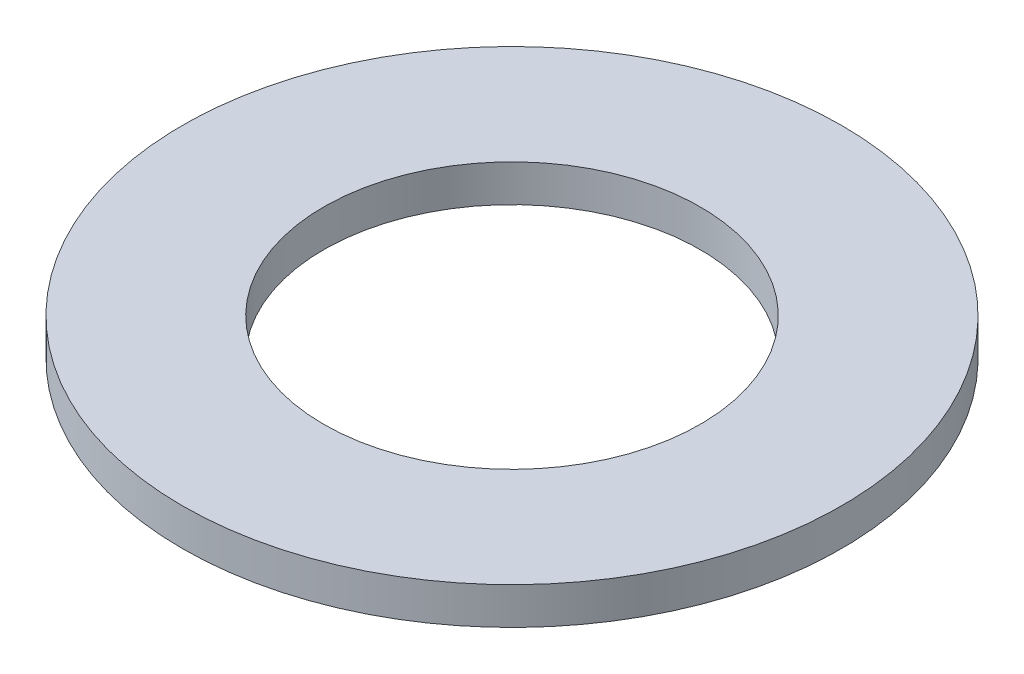
ISO-10303-21;
HEADER;
FILE_DESCRIPTION(('STEP AP214'),'2;1');
FILE_NAME('part.step','',(''),(''),'','','');
FILE_SCHEMA(('AUTOMOTIVE_DESIGN { 1 0 10303 214 1 1 1 1 }'));
ENDSEC;
DATA;
#1=APPLICATION_CONTEXT('core data for automotive mechanical design processes');
#2=APPLICATION_PROTOCOL_DEFINITION('international standard','automotive_design',2000,#1);
#3=PRODUCT_CONTEXT('',#1,'mechanical');
#4=PRODUCT('Part','Part','',(#3));
#5=PRODUCT_RELATED_PRODUCT_CATEGORY('part','',(#4));
#6=PRODUCT_DEFINITION_FORMATION('','',#4);
#7=PRODUCT_DEFINITION_CONTEXT('part definition',#1,'design');
#8=PRODUCT_DEFINITION('design','',#6,#7);
#9=PRODUCT_DEFINITION_SHAPE('','',#8);
#10=(LENGTH_UNIT() NAMED_UNIT(*) SI_UNIT(.MILLI.,.METRE.));
#11=(NAMED_UNIT(*) PLANE_ANGLE_UNIT() SI_UNIT($,.RADIAN.));
#12=(NAMED_UNIT(*) SI_UNIT($,.STERADIAN.) SOLID_ANGLE_UNIT());
#13=UNCERTAINTY_MEASURE_WITH_UNIT(LENGTH_MEASURE(1.E-05),#10,'distance_accuracy_value','');
#14=(GEOMETRIC_REPRESENTATION_CONTEXT(3) GLOBAL_UNCERTAINTY_ASSIGNED_CONTEXT((#13)) GLOBAL_UNIT_ASSIGNED_CONTEXT((#10,
#11,#12)) REPRESENTATION_CONTEXT('',''));
#15=CARTESIAN_POINT('',(0.,0.,0.));
#16=DIRECTION('',(0.,0.,1.));
#17=DIRECTION('',(1.,0.,0.));
#18=AXIS2_PLACEMENT_3D('',#15,#16,#17);
#19=CARTESIAN_POINT('',(0.,10.,0.));
#20=DIRECTION('',(0.,-1.,0.));
#21=DIRECTION('',(0.,0.,-1.));
#22=AXIS2_PLACEMENT_3D('',#19,#20,#21);
#23=CYLINDRICAL_SURFACE('',#22,88.9);
#24=CARTESIAN_POINT('',(0.,10.,0.));
#25=DIRECTION('',(0.,1.,0.));
#26=DIRECTION('',(0.,0.,1.));
#27=AXIS2_PLACEMENT_3D('',#24,#25,#26);
#28=CIRCLE('',#27,88.9);
#29=CARTESIAN_POINT('',(0.,10.,88.9));
#30=VERTEX_POINT('',#29);
#31=EDGE_CURVE('E10',#30,#30,#28,.T.);
#32=ORIENTED_EDGE('',*,*,#31,.F.);
#33=EDGE_LOOP('',(#32));
#34=FACE_BOUND('',#33,.T.);
#35=CARTESIAN_POINT('',(0.,0.,0.));
#36=DIRECTION('',(0.,1.,0.));
#37=DIRECTION('',(0.,0.,1.));
#38=AXIS2_PLACEMENT_3D('',#35,#36,#37);
#39=CIRCLE('',#38,88.9);
#40=CARTESIAN_POINT('',(0.,0.,88.9));
#41=VERTEX_POINT('',#40);
#42=EDGE_CURVE('E39',#41,#41,#39,.T.);
#43=ORIENTED_EDGE('',*,*,#42,.T.);
#44=EDGE_LOOP('',(#43));
#45=FACE_BOUND('',#44,.T.);
#46=ADVANCED_FACE('F36',(#34,#45),#23,.T.);
#47=CARTESIAN_POINT('',(0.,10.,0.));
#48=DIRECTION('',(0.,1.,0.));
#49=DIRECTION('',(0.,0.,1.));
#50=AXIS2_PLACEMENT_3D('',#47,#48,#49);
#51=PLANE('',#50);
#52=CARTESIAN_POINT('',(0.,10.,0.));
#53=DIRECTION('',(0.,1.,0.));
#54=DIRECTION('',(0.,0.,1.));
#55=AXIS2_PLACEMENT_3D('',#52,#53,#54);
#56=CIRCLE('',#55,50.8);
#57=CARTESIAN_POINT('',(0.,10.,50.8));
#58=VERTEX_POINT('',#57);
#59=EDGE_CURVE('E48',#58,#58,#56,.F.);
#60=ORIENTED_EDGE('',*,*,#59,.T.);
#61=EDGE_LOOP('',(#60));
#62=FACE_BOUND('',#61,.T.);
#63=ORIENTED_EDGE('',*,*,#31,.T.);
#64=EDGE_LOOP('',(#63));
#65=FACE_BOUND('',#64,.T.);
#66=ADVANCED_FACE('F68',(#62,#65),#51,.T.);
#67=CARTESIAN_POINT('',(0.,0.,0.));
#68=DIRECTION('',(0.,1.,0.));
#69=DIRECTION('',(0.,0.,1.));
#70=AXIS2_PLACEMENT_3D('',#67,#68,#69);
#71=PLANE('',#70);
#72=CARTESIAN_POINT('',(0.,0.,0.));
#73=DIRECTION('',(0.,1.,0.));
#74=DIRECTION('',(0.,0.,1.));
#75=AXIS2_PLACEMENT_3D('',#72,#73,#74);
#76=CIRCLE('',#75,50.8);
#77=CARTESIAN_POINT('',(0.,0.,50.8));
#78=VERTEX_POINT('',#77);
#79=EDGE_CURVE('E53',#78,#78,#76,.T.);
#80=ORIENTED_EDGE('',*,*,#79,.T.);
#81=EDGE_LOOP('',(#80));
#82=FACE_BOUND('',#81,.T.);
#83=ORIENTED_EDGE('',*,*,#42,.F.);
#84=EDGE_LOOP('',(#83));
#85=FACE_BOUND('',#84,.T.);
#86=ADVANCED_FACE('F58',(#82,#85),#71,.F.);
#87=CARTESIAN_POINT('',(0.,15.,0.));
#88=DIRECTION('',(0.,-1.,0.));
#89=DIRECTION('',(0.,0.,-1.));
#90=AXIS2_PLACEMENT_3D('',#87,#88,#89);
#91=CYLINDRICAL_SURFACE('',#90,50.8);
#92=ORIENTED_EDGE('',*,*,#59,.F.);
#93=EDGE_LOOP('',(#92));
#94=FACE_BOUND('',#93,.T.);
#95=ORIENTED_EDGE('',*,*,#79,.F.);
#96=EDGE_LOOP('',(#95));
#97=FACE_BOUND('',#96,.T.);
#98=ADVANCED_FACE('F61',(#94,#97),#91,.F.);
#99=CLOSED_SHELL('',(#46,#66,#86,#98));
#100=MANIFOLD_SOLID_BREP('B2',#99);
#101=ADVANCED_BREP_SHAPE_REPRESENTATION('',(#18,#100),#14);
#102=SHAPE_DEFINITION_REPRESENTATION(#9,#101);
ENDSEC;
END-ISO-10303-21;
